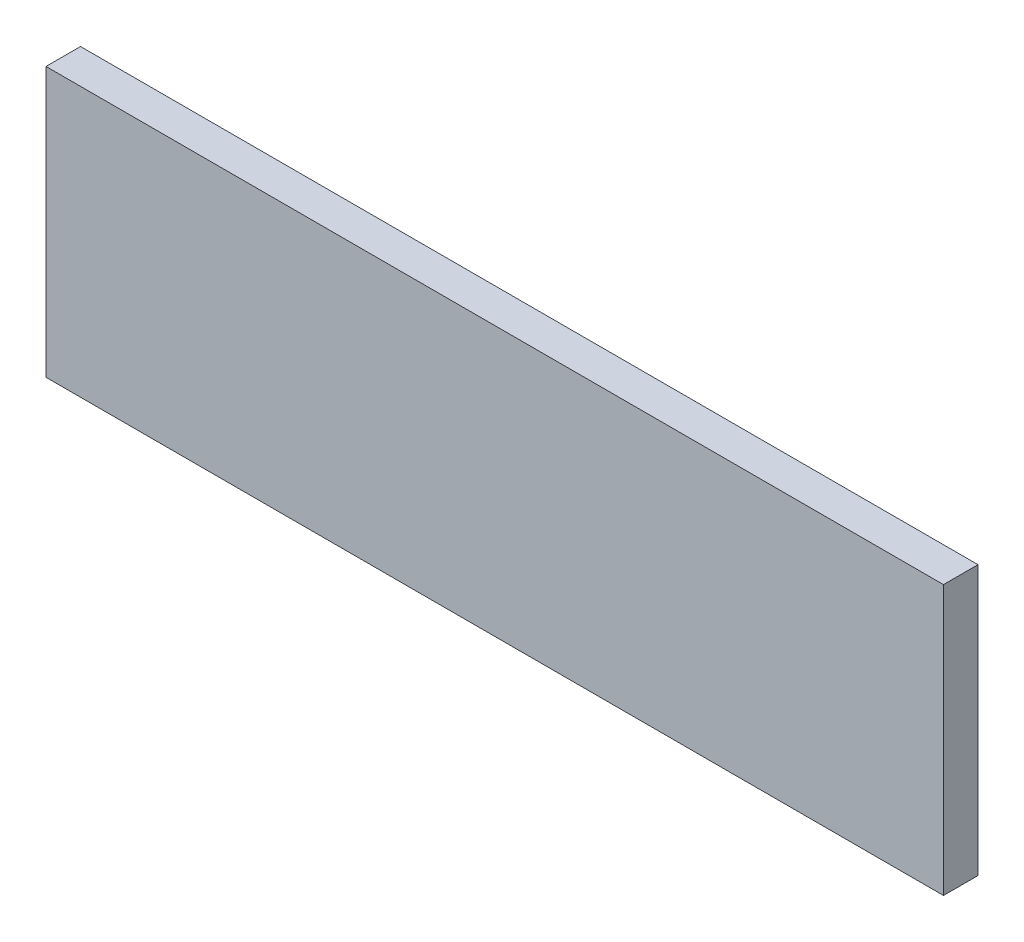
ISO-10303-21;
HEADER;
FILE_DESCRIPTION(('STEP AP214'),'2;1');
FILE_NAME('part.step','',(''),(''),'','','');
FILE_SCHEMA(('AUTOMOTIVE_DESIGN { 1 0 10303 214 1 1 1 1 }'));
ENDSEC;
DATA;
#1=APPLICATION_CONTEXT('core data for automotive mechanical design processes');
#2=APPLICATION_PROTOCOL_DEFINITION('international standard','automotive_design',2000,#1);
#3=PRODUCT_CONTEXT('',#1,'mechanical');
#4=PRODUCT('Part','Part','',(#3));
#5=PRODUCT_RELATED_PRODUCT_CATEGORY('part','',(#4));
#6=PRODUCT_DEFINITION_FORMATION('','',#4);
#7=PRODUCT_DEFINITION_CONTEXT('part definition',#1,'design');
#8=PRODUCT_DEFINITION('design','',#6,#7);
#9=PRODUCT_DEFINITION_SHAPE('','',#8);
#10=(LENGTH_UNIT() NAMED_UNIT(*) SI_UNIT(.MILLI.,.METRE.));
#11=(NAMED_UNIT(*) PLANE_ANGLE_UNIT() SI_UNIT($,.RADIAN.));
#12=(NAMED_UNIT(*) SI_UNIT($,.STERADIAN.) SOLID_ANGLE_UNIT());
#13=UNCERTAINTY_MEASURE_WITH_UNIT(LENGTH_MEASURE(1.E-05),#10,'distance_accuracy_value','');
#14=(GEOMETRIC_REPRESENTATION_CONTEXT(3) GLOBAL_UNCERTAINTY_ASSIGNED_CONTEXT((#13)) GLOBAL_UNIT_ASSIGNED_CONTEXT((#10,
#11,#12)) REPRESENTATION_CONTEXT('',''));
#15=CARTESIAN_POINT('',(0.,0.,0.));
#16=DIRECTION('',(0.,0.,1.));
#17=DIRECTION('',(1.,0.,0.));
#18=AXIS2_PLACEMENT_3D('',#15,#16,#17);
#19=CARTESIAN_POINT('',(0.,0.,1.27));
#20=DIRECTION('',(1.,0.,0.));
#21=DIRECTION('',(0.,0.,-1.));
#22=AXIS2_PLACEMENT_3D('',#19,#20,#21);
#23=PLANE('',#22);
#24=DIRECTION('',(0.,-1.,0.));
#25=VECTOR('',#24,1.);
#26=CARTESIAN_POINT('',(0.,0.,0.));
#27=LINE('',#26,#25);
#28=CARTESIAN_POINT('',(0.,9.906,0.));
#29=VERTEX_POINT('',#28);
#30=CARTESIAN_POINT('',(0.,0.,0.));
#31=VERTEX_POINT('',#30);
#32=EDGE_CURVE('E107',#29,#31,#27,.T.);
#33=ORIENTED_EDGE('',*,*,#32,.T.);
#34=DIRECTION('',(0.,0.,-1.));
#35=VECTOR('',#34,1.);
#36=CARTESIAN_POINT('',(0.,0.,1.27));
#37=LINE('',#36,#35);
#38=CARTESIAN_POINT('',(0.,0.,1.27));
#39=VERTEX_POINT('',#38);
#40=EDGE_CURVE('E11',#39,#31,#37,.T.);
#41=ORIENTED_EDGE('',*,*,#40,.F.);
#42=DIRECTION('',(0.,-1.,0.));
#43=VECTOR('',#42,1.);
#44=CARTESIAN_POINT('',(0.,0.,1.27));
#45=LINE('',#44,#43);
#46=CARTESIAN_POINT('',(0.,9.906,1.27));
#47=VERTEX_POINT('',#46);
#48=EDGE_CURVE('E91',#47,#39,#45,.T.);
#49=ORIENTED_EDGE('',*,*,#48,.F.);
#50=DIRECTION('',(0.,0.,-1.));
#51=VECTOR('',#50,1.);
#52=CARTESIAN_POINT('',(0.,9.906,1.27));
#53=LINE('',#52,#51);
#54=EDGE_CURVE('E103',#47,#29,#53,.T.);
#55=ORIENTED_EDGE('',*,*,#54,.T.);
#56=EDGE_LOOP('',(#33,#41,#49,#55));
#57=FACE_BOUND('',#56,.T.);
#58=ADVANCED_FACE('F39',(#57),#23,.F.);
#59=CARTESIAN_POINT('',(0.,0.,1.27));
#60=DIRECTION('',(0.,1.,0.));
#61=DIRECTION('',(0.,0.,1.));
#62=AXIS2_PLACEMENT_3D('',#59,#60,#61);
#63=PLANE('',#62);
#64=DIRECTION('',(1.,0.,0.));
#65=VECTOR('',#64,1.);
#66=CARTESIAN_POINT('',(0.,0.,0.));
#67=LINE('',#66,#65);
#68=CARTESIAN_POINT('',(33.02,0.,0.));
#69=VERTEX_POINT('',#68);
#70=EDGE_CURVE('E96',#31,#69,#67,.T.);
#71=ORIENTED_EDGE('',*,*,#70,.T.);
#72=DIRECTION('',(0.,0.,-1.));
#73=VECTOR('',#72,1.);
#74=CARTESIAN_POINT('',(33.02,0.,1.27));
#75=LINE('',#74,#73);
#76=CARTESIAN_POINT('',(33.02,0.,1.27));
#77=VERTEX_POINT('',#76);
#78=EDGE_CURVE('E48',#77,#69,#75,.T.);
#79=ORIENTED_EDGE('',*,*,#78,.F.);
#80=DIRECTION('',(1.,0.,0.));
#81=VECTOR('',#80,1.);
#82=CARTESIAN_POINT('',(0.,0.,1.27));
#83=LINE('',#82,#81);
#84=EDGE_CURVE('E86',#39,#77,#83,.T.);
#85=ORIENTED_EDGE('',*,*,#84,.F.);
#86=ORIENTED_EDGE('',*,*,#40,.T.);
#87=EDGE_LOOP('',(#71,#79,#85,#86));
#88=FACE_BOUND('',#87,.T.);
#89=ADVANCED_FACE('F95',(#88),#63,.F.);
#90=CARTESIAN_POINT('',(33.02,0.,1.27));
#91=DIRECTION('',(-1.,0.,0.));
#92=DIRECTION('',(0.,0.,1.));
#93=AXIS2_PLACEMENT_3D('',#90,#91,#92);
#94=PLANE('',#93);
#95=DIRECTION('',(0.,1.,0.));
#96=VECTOR('',#95,1.);
#97=CARTESIAN_POINT('',(33.02,0.,0.));
#98=LINE('',#97,#96);
#99=CARTESIAN_POINT('',(33.02,9.906,0.));
#100=VERTEX_POINT('',#99);
#101=EDGE_CURVE('E73',#69,#100,#98,.T.);
#102=ORIENTED_EDGE('',*,*,#101,.T.);
#103=DIRECTION('',(0.,0.,-1.));
#104=VECTOR('',#103,1.);
#105=CARTESIAN_POINT('',(33.02,9.906,1.27));
#106=LINE('',#105,#104);
#107=CARTESIAN_POINT('',(33.02,9.906,1.27));
#108=VERTEX_POINT('',#107);
#109=EDGE_CURVE('E98',#108,#100,#106,.T.);
#110=ORIENTED_EDGE('',*,*,#109,.F.);
#111=DIRECTION('',(0.,1.,0.));
#112=VECTOR('',#111,1.);
#113=CARTESIAN_POINT('',(33.02,0.,1.27));
#114=LINE('',#113,#112);
#115=EDGE_CURVE('E89',#77,#108,#114,.T.);
#116=ORIENTED_EDGE('',*,*,#115,.F.);
#117=ORIENTED_EDGE('',*,*,#78,.T.);
#118=EDGE_LOOP('',(#102,#110,#116,#117));
#119=FACE_BOUND('',#118,.T.);
#120=ADVANCED_FACE('F99',(#119),#94,.F.);
#121=CARTESIAN_POINT('',(0.,9.906,1.27));
#122=DIRECTION('',(0.,-1.,0.));
#123=DIRECTION('',(0.,0.,-1.));
#124=AXIS2_PLACEMENT_3D('',#121,#122,#123);
#125=PLANE('',#124);
#126=DIRECTION('',(-1.,0.,0.));
#127=VECTOR('',#126,1.);
#128=CARTESIAN_POINT('',(0.,9.906,0.));
#129=LINE('',#128,#127);
#130=EDGE_CURVE('E79',#100,#29,#129,.T.);
#131=ORIENTED_EDGE('',*,*,#130,.T.);
#132=ORIENTED_EDGE('',*,*,#54,.F.);
#133=DIRECTION('',(-1.,0.,0.));
#134=VECTOR('',#133,1.);
#135=CARTESIAN_POINT('',(0.,9.906,1.27));
#136=LINE('',#135,#134);
#137=EDGE_CURVE('E56',#108,#47,#136,.T.);
#138=ORIENTED_EDGE('',*,*,#137,.F.);
#139=ORIENTED_EDGE('',*,*,#109,.T.);
#140=EDGE_LOOP('',(#131,#132,#138,#139));
#141=FACE_BOUND('',#140,.T.);
#142=ADVANCED_FACE('F120',(#141),#125,.F.);
#143=CARTESIAN_POINT('',(0.,0.,1.27));
#144=DIRECTION('',(0.,0.,-1.));
#145=DIRECTION('',(-1.,0.,0.));
#146=AXIS2_PLACEMENT_3D('',#143,#144,#145);
#147=PLANE('',#146);
#148=ORIENTED_EDGE('',*,*,#48,.T.);
#149=ORIENTED_EDGE('',*,*,#84,.T.);
#150=ORIENTED_EDGE('',*,*,#115,.T.);
#151=ORIENTED_EDGE('',*,*,#137,.T.);
#152=EDGE_LOOP('',(#148,#149,#150,#151));
#153=FACE_BOUND('',#152,.T.);
#154=ADVANCED_FACE('F87',(#153),#147,.F.);
#155=CARTESIAN_POINT('',(0.,0.,0.));
#156=DIRECTION('',(0.,0.,-1.));
#157=DIRECTION('',(-1.,0.,0.));
#158=AXIS2_PLACEMENT_3D('',#155,#156,#157);
#159=PLANE('',#158);
#160=ORIENTED_EDGE('',*,*,#32,.F.);
#161=ORIENTED_EDGE('',*,*,#130,.F.);
#162=ORIENTED_EDGE('',*,*,#101,.F.);
#163=ORIENTED_EDGE('',*,*,#70,.F.);
#164=EDGE_LOOP('',(#160,#161,#162,#163));
#165=FACE_BOUND('',#164,.T.);
#166=ADVANCED_FACE('F123',(#165),#159,.T.);
#167=CLOSED_SHELL('',(#58,#89,#120,#142,#154,#166));
#168=MANIFOLD_SOLID_BREP('B2',#167);
#169=ADVANCED_BREP_SHAPE_REPRESENTATION('',(#18,#168),#14);
#170=SHAPE_DEFINITION_REPRESENTATION(#9,#169);
ENDSEC;
END-ISO-10303-21;
